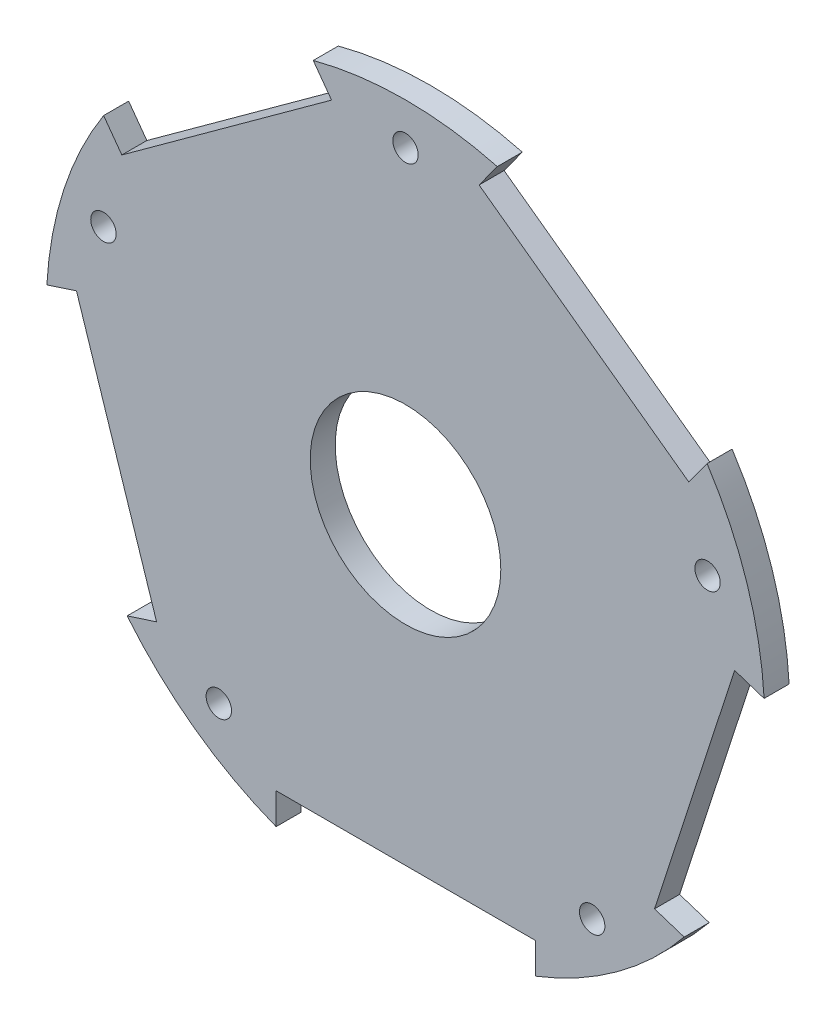
ISO-10303-21;
HEADER;
FILE_DESCRIPTION(('STEP AP214'),'2;1');
FILE_NAME('part.step','',(''),(''),'','','');
FILE_SCHEMA(('AUTOMOTIVE_DESIGN { 1 0 10303 214 1 1 1 1 }'));
ENDSEC;
DATA;
#1=APPLICATION_CONTEXT('core data for automotive mechanical design processes');
#2=APPLICATION_PROTOCOL_DEFINITION('international standard','automotive_design',2000,#1);
#3=PRODUCT_CONTEXT('',#1,'mechanical');
#4=PRODUCT('Part','Part','',(#3));
#5=PRODUCT_RELATED_PRODUCT_CATEGORY('part','',(#4));
#6=PRODUCT_DEFINITION_FORMATION('','',#4);
#7=PRODUCT_DEFINITION_CONTEXT('part definition',#1,'design');
#8=PRODUCT_DEFINITION('design','',#6,#7);
#9=PRODUCT_DEFINITION_SHAPE('','',#8);
#10=(LENGTH_UNIT() NAMED_UNIT(*) SI_UNIT(.MILLI.,.METRE.));
#11=(NAMED_UNIT(*) PLANE_ANGLE_UNIT() SI_UNIT($,.RADIAN.));
#12=(NAMED_UNIT(*) SI_UNIT($,.STERADIAN.) SOLID_ANGLE_UNIT());
#13=UNCERTAINTY_MEASURE_WITH_UNIT(LENGTH_MEASURE(1.E-05),#10,'distance_accuracy_value','');
#14=(GEOMETRIC_REPRESENTATION_CONTEXT(3) GLOBAL_UNCERTAINTY_ASSIGNED_CONTEXT((#13)) GLOBAL_UNIT_ASSIGNED_CONTEXT((#10,
#11,#12)) REPRESENTATION_CONTEXT('',''));
#15=CARTESIAN_POINT('',(0.,0.,0.));
#16=DIRECTION('',(0.,0.,1.));
#17=DIRECTION('',(1.,0.,0.));
#18=AXIS2_PLACEMENT_3D('',#15,#16,#17);
#19=CARTESIAN_POINT('',(124.233271228928,-185.773155673186,5.0038));
#20=DIRECTION('',(0.309016994374931,-0.951056516295159,0.));
#21=DIRECTION('',(0.951056516295159,0.309016994374931,0.));
#22=AXIS2_PLACEMENT_3D('',#19,#20,#21);
#23=PLANE('',#22);
#24=DIRECTION('',(-0.951056516295159,-0.309016994374931,0.));
#25=VECTOR('',#24,1.);
#26=CARTESIAN_POINT('',(124.233271228928,-185.773155673186,0.));
#27=LINE('',#26,#25);
#28=CARTESIAN_POINT('',(100.856418168785,-193.368755668369,0.));
#29=VERTEX_POINT('',#28);
#30=CARTESIAN_POINT('',(94.9700362155549,-195.281357104523,0.));
#31=VERTEX_POINT('',#30);
#32=EDGE_CURVE('E211',#29,#31,#27,.T.);
#33=ORIENTED_EDGE('',*,*,#32,.T.);
#34=DIRECTION('',(0.,0.,-1.));
#35=VECTOR('',#34,1.);
#36=CARTESIAN_POINT('',(94.9700362155549,-195.281357104523,5.0038));
#37=LINE('',#36,#35);
#38=CARTESIAN_POINT('',(94.9700362155549,-195.281357104523,5.0038));
#39=VERTEX_POINT('',#38);
#40=EDGE_CURVE('E11',#39,#31,#37,.T.);
#41=ORIENTED_EDGE('',*,*,#40,.F.);
#42=DIRECTION('',(-0.951056516295159,-0.309016994374931,0.));
#43=VECTOR('',#42,1.);
#44=CARTESIAN_POINT('',(124.233271228928,-185.773155673186,5.0038));
#45=LINE('',#44,#43);
#46=CARTESIAN_POINT('',(100.856418168785,-193.368755668369,5.0038));
#47=VERTEX_POINT('',#46);
#48=EDGE_CURVE('E320',#47,#39,#45,.T.);
#49=ORIENTED_EDGE('',*,*,#48,.F.);
#50=DIRECTION('',(0.,0.,-1.));
#51=VECTOR('',#50,1.);
#52=CARTESIAN_POINT('',(100.856418168785,-193.368755668369,5.0038));
#53=LINE('',#52,#51);
#54=EDGE_CURVE('E54',#47,#29,#53,.T.);
#55=ORIENTED_EDGE('',*,*,#54,.T.);
#56=EDGE_LOOP('',(#33,#41,#49,#55));
#57=FACE_BOUND('',#56,.T.);
#58=ADVANCED_FACE('F37',(#57),#23,.F.);
#59=CARTESIAN_POINT('',(150.608180965408,-149.916372010794,5.0038));
#60=DIRECTION('',(0.,0.,-1.));
#61=DIRECTION('',(-1.,0.,0.));
#62=AXIS2_PLACEMENT_3D('',#59,#60,#61);
#63=CYLINDRICAL_SURFACE('',#62,71.7884741707181);
#64=CARTESIAN_POINT('',(150.608180965408,-149.916372010794,0.));
#65=DIRECTION('',(0.,0.,1.));
#66=DIRECTION('',(1.,0.,0.));
#67=AXIS2_PLACEMENT_3D('',#64,#65,#66);
#68=CIRCLE('',#67,71.7884741707181);
#69=CARTESIAN_POINT('',(124.743713387235,-216.883635211984,0.));
#70=VERTEX_POINT('',#69);
#71=EDGE_CURVE('E214',#31,#70,#68,.T.);
#72=ORIENTED_EDGE('',*,*,#71,.T.);
#73=DIRECTION('',(0.,0.,-1.));
#74=VECTOR('',#73,1.);
#75=CARTESIAN_POINT('',(124.743713387235,-216.883635211984,5.0038));
#76=LINE('',#75,#74);
#77=CARTESIAN_POINT('',(124.743713387235,-216.883635211984,5.0038));
#78=VERTEX_POINT('',#77);
#79=EDGE_CURVE('E46',#78,#70,#76,.T.);
#80=ORIENTED_EDGE('',*,*,#79,.F.);
#81=CARTESIAN_POINT('',(150.608180965408,-149.916372010794,5.0038));
#82=DIRECTION('',(0.,0.,1.));
#83=DIRECTION('',(1.,0.,0.));
#84=AXIS2_PLACEMENT_3D('',#81,#82,#83);
#85=CIRCLE('',#84,71.7884741707181);
#86=EDGE_CURVE('E128',#39,#78,#85,.T.);
#87=ORIENTED_EDGE('',*,*,#86,.F.);
#88=ORIENTED_EDGE('',*,*,#40,.T.);
#89=EDGE_LOOP('',(#72,#80,#87,#88));
#90=FACE_BOUND('',#89,.T.);
#91=ADVANCED_FACE('F304',(#90),#63,.T.);
#92=CARTESIAN_POINT('',(124.743713387234,-300.002561728029,5.0038));
#93=DIRECTION('',(1.,0.,0.));
#94=DIRECTION('',(0.,1.,0.));
#95=AXIS2_PLACEMENT_3D('',#92,#93,#94);
#96=PLANE('',#95);
#97=DIRECTION('',(0.,-1.,0.));
#98=VECTOR('',#97,1.);
#99=CARTESIAN_POINT('',(124.743713387234,-300.002561728029,0.));
#100=LINE('',#99,#98);
#101=CARTESIAN_POINT('',(124.743713387235,-210.660635211985,0.));
#102=VERTEX_POINT('',#101);
#103=EDGE_CURVE('E217',#102,#70,#100,.T.);
#104=ORIENTED_EDGE('',*,*,#103,.F.);
#105=DIRECTION('',(0.,0.,-1.));
#106=VECTOR('',#105,1.);
#107=CARTESIAN_POINT('',(124.743713387235,-210.660635211985,5.0038));
#108=LINE('',#107,#106);
#109=CARTESIAN_POINT('',(124.743713387235,-210.660635211985,5.0038));
#110=VERTEX_POINT('',#109);
#111=EDGE_CURVE('E297',#110,#102,#108,.T.);
#112=ORIENTED_EDGE('',*,*,#111,.F.);
#113=DIRECTION('',(0.,-1.,0.));
#114=VECTOR('',#113,1.);
#115=CARTESIAN_POINT('',(124.743713387234,-300.002561728029,5.0038));
#116=LINE('',#115,#114);
#117=EDGE_CURVE('E303',#110,#78,#116,.T.);
#118=ORIENTED_EDGE('',*,*,#117,.T.);
#119=ORIENTED_EDGE('',*,*,#79,.T.);
#120=EDGE_LOOP('',(#104,#112,#118,#119));
#121=FACE_BOUND('',#120,.T.);
#122=ADVANCED_FACE('F301',(#121),#96,.T.);
#123=CARTESIAN_POINT('',(161.348655145131,-210.660635211985,5.0038));
#124=DIRECTION('',(0.,-1.,0.));
#125=DIRECTION('',(0.,0.,-1.));
#126=AXIS2_PLACEMENT_3D('',#123,#124,#125);
#127=PLANE('',#126);
#128=DIRECTION('',(-1.,0.,0.));
#129=VECTOR('',#128,1.);
#130=CARTESIAN_POINT('',(161.348655145131,-210.660635211985,0.));
#131=LINE('',#130,#129);
#132=CARTESIAN_POINT('',(176.559713387235,-210.660635211985,0.));
#133=VERTEX_POINT('',#132);
#134=EDGE_CURVE('E220',#133,#102,#131,.T.);
#135=ORIENTED_EDGE('',*,*,#134,.F.);
#136=DIRECTION('',(0.,0.,-1.));
#137=VECTOR('',#136,1.);
#138=CARTESIAN_POINT('',(176.559713387235,-210.660635211985,5.0038));
#139=LINE('',#138,#137);
#140=CARTESIAN_POINT('',(176.559713387235,-210.660635211985,5.0038));
#141=VERTEX_POINT('',#140);
#142=EDGE_CURVE('E295',#141,#133,#139,.T.);
#143=ORIENTED_EDGE('',*,*,#142,.F.);
#144=DIRECTION('',(-1.,0.,0.));
#145=VECTOR('',#144,1.);
#146=CARTESIAN_POINT('',(161.348655145131,-210.660635211985,5.0038));
#147=LINE('',#146,#145);
#148=EDGE_CURVE('E316',#141,#110,#147,.T.);
#149=ORIENTED_EDGE('',*,*,#148,.T.);
#150=ORIENTED_EDGE('',*,*,#111,.T.);
#151=EDGE_LOOP('',(#135,#143,#149,#150));
#152=FACE_BOUND('',#151,.T.);
#153=ADVANCED_FACE('F312',(#152),#127,.T.);
#154=CARTESIAN_POINT('',(176.559713387234,-300.00256172803,5.0038));
#155=DIRECTION('',(1.,0.,0.));
#156=DIRECTION('',(0.,1.,0.));
#157=AXIS2_PLACEMENT_3D('',#154,#155,#156);
#158=PLANE('',#157);
#159=DIRECTION('',(0.,-1.,0.));
#160=VECTOR('',#159,1.);
#161=CARTESIAN_POINT('',(176.559713387234,-300.00256172803,0.));
#162=LINE('',#161,#160);
#163=CARTESIAN_POINT('',(176.559713387235,-216.849943473244,0.));
#164=VERTEX_POINT('',#163);
#165=EDGE_CURVE('E223',#133,#164,#162,.T.);
#166=ORIENTED_EDGE('',*,*,#165,.T.);
#167=DIRECTION('',(0.,0.,-1.));
#168=VECTOR('',#167,1.);
#169=CARTESIAN_POINT('',(176.559713387235,-216.849943473244,5.0038));
#170=LINE('',#169,#168);
#171=CARTESIAN_POINT('',(176.559713387235,-216.849943473244,5.0038));
#172=VERTEX_POINT('',#171);
#173=EDGE_CURVE('E292',#172,#164,#170,.T.);
#174=ORIENTED_EDGE('',*,*,#173,.F.);
#175=DIRECTION('',(0.,-1.,0.));
#176=VECTOR('',#175,1.);
#177=CARTESIAN_POINT('',(176.559713387234,-300.00256172803,5.0038));
#178=LINE('',#177,#176);
#179=EDGE_CURVE('E318',#141,#172,#178,.T.);
#180=ORIENTED_EDGE('',*,*,#179,.F.);
#181=ORIENTED_EDGE('',*,*,#142,.T.);
#182=EDGE_LOOP('',(#166,#174,#180,#181));
#183=FACE_BOUND('',#182,.T.);
#184=ADVANCED_FACE('F383',(#183),#158,.F.);
#185=CARTESIAN_POINT('',(150.608180965408,-149.916372010794,5.0038));
#186=DIRECTION('',(0.,0.,-1.));
#187=DIRECTION('',(-1.,0.,0.));
#188=AXIS2_PLACEMENT_3D('',#185,#186,#187);
#189=CYLINDRICAL_SURFACE('',#188,71.7884741707186);
#190=CARTESIAN_POINT('',(150.608180965408,-149.916372010794,0.));
#191=DIRECTION('',(0.,0.,1.));
#192=DIRECTION('',(1.,0.,0.));
#193=AXIS2_PLACEMENT_3D('',#190,#191,#192);
#194=CIRCLE('',#193,71.7884741707186);
#195=CARTESIAN_POINT('',(206.305272979238,-195.208964837469,0.));
#196=VERTEX_POINT('',#195);
#197=EDGE_CURVE('E225',#164,#196,#194,.T.);
#198=ORIENTED_EDGE('',*,*,#197,.T.);
#199=DIRECTION('',(0.,0.,-1.));
#200=VECTOR('',#199,1.);
#201=CARTESIAN_POINT('',(206.305272979238,-195.208964837469,5.0038));
#202=LINE('',#201,#200);
#203=CARTESIAN_POINT('',(206.305272979238,-195.208964837469,5.0038));
#204=VERTEX_POINT('',#203);
#205=EDGE_CURVE('E290',#204,#196,#202,.T.);
#206=ORIENTED_EDGE('',*,*,#205,.F.);
#207=CARTESIAN_POINT('',(150.608180965408,-149.916372010794,5.0038));
#208=DIRECTION('',(0.,0.,1.));
#209=DIRECTION('',(1.,0.,0.));
#210=AXIS2_PLACEMENT_3D('',#207,#208,#209);
#211=CIRCLE('',#210,71.7884741707186);
#212=EDGE_CURVE('E325',#172,#204,#211,.T.);
#213=ORIENTED_EDGE('',*,*,#212,.F.);
#214=ORIENTED_EDGE('',*,*,#173,.T.);
#215=EDGE_LOOP('',(#198,#206,#213,#214));
#216=FACE_BOUND('',#215,.T.);
#217=ADVANCED_FACE('F386',(#216),#189,.T.);
#218=CARTESIAN_POINT('',(196.439695536956,-192.00344441176,5.0038));
#219=DIRECTION('',(0.309016994374956,0.951056516295151,0.));
#220=DIRECTION('',(-0.951056516295151,0.309016994374956,0.));
#221=AXIS2_PLACEMENT_3D('',#218,#219,#220);
#222=PLANE('',#221);
#223=DIRECTION('',(0.951056516295151,-0.309016994374956,0.));
#224=VECTOR('',#223,1.);
#225=CARTESIAN_POINT('',(196.439695536956,-192.00344441176,0.));
#226=LINE('',#225,#224);
#227=CARTESIAN_POINT('',(200.386848278333,-193.285952081473,0.));
#228=VERTEX_POINT('',#227);
#229=EDGE_CURVE('E228',#228,#196,#226,.T.);
#230=ORIENTED_EDGE('',*,*,#229,.F.);
#231=DIRECTION('',(0.,0.,-1.));
#232=VECTOR('',#231,1.);
#233=CARTESIAN_POINT('',(200.386848278333,-193.285952081473,5.0038));
#234=LINE('',#233,#232);
#235=CARTESIAN_POINT('',(200.386848278333,-193.285952081473,5.0038));
#236=VERTEX_POINT('',#235);
#237=EDGE_CURVE('E288',#236,#228,#234,.T.);
#238=ORIENTED_EDGE('',*,*,#237,.F.);
#239=DIRECTION('',(0.951056516295151,-0.309016994374956,0.));
#240=VECTOR('',#239,1.);
#241=CARTESIAN_POINT('',(196.439695536956,-192.00344441176,5.0038));
#242=LINE('',#241,#240);
#243=EDGE_CURVE('E327',#236,#204,#242,.T.);
#244=ORIENTED_EDGE('',*,*,#243,.T.);
#245=ORIENTED_EDGE('',*,*,#205,.T.);
#246=EDGE_LOOP('',(#230,#238,#244,#245));
#247=FACE_BOUND('',#246,.T.);
#248=ADVANCED_FACE('F390',(#247),#222,.T.);
#249=CARTESIAN_POINT('',(165.295807886508,-301.285069397743,5.0038));
#250=DIRECTION('',(0.95105651629515,-0.309016994374957,0.));
#251=DIRECTION('',(0.309016994374957,0.951056516295151,0.));
#252=AXIS2_PLACEMENT_3D('',#249,#250,#251);
#253=PLANE('',#252);
#254=DIRECTION('',(-0.309016994374957,-0.95105651629515,0.));
#255=VECTOR('',#254,1.);
#256=CARTESIAN_POINT('',(165.295807886508,-301.285069397743,0.));
#257=LINE('',#256,#255);
#258=CARTESIAN_POINT('',(216.398872858866,-144.006007633124,0.));
#259=VERTEX_POINT('',#258);
#260=EDGE_CURVE('E231',#259,#228,#257,.T.);
#261=ORIENTED_EDGE('',*,*,#260,.F.);
#262=DIRECTION('',(0.,0.,-1.));
#263=VECTOR('',#262,1.);
#264=CARTESIAN_POINT('',(216.398872858866,-144.006007633124,5.0038));
#265=LINE('',#264,#263);
#266=CARTESIAN_POINT('',(216.398872858866,-144.006007633124,5.0038));
#267=VERTEX_POINT('',#266);
#268=EDGE_CURVE('E286',#267,#259,#265,.T.);
#269=ORIENTED_EDGE('',*,*,#268,.F.);
#270=DIRECTION('',(-0.309016994374957,-0.95105651629515,0.));
#271=VECTOR('',#270,1.);
#272=CARTESIAN_POINT('',(165.295807886508,-301.285069397743,5.0038));
#273=LINE('',#272,#271);
#274=EDGE_CURVE('E330',#267,#236,#273,.T.);
#275=ORIENTED_EDGE('',*,*,#274,.T.);
#276=ORIENTED_EDGE('',*,*,#237,.T.);
#277=EDGE_LOOP('',(#261,#269,#275,#276));
#278=FACE_BOUND('',#277,.T.);
#279=ADVANCED_FACE('F394',(#278),#253,.T.);
#280=CARTESIAN_POINT('',(212.451720117488,-142.72349996341,5.0038));
#281=DIRECTION('',(0.309016994374954,0.951056516295151,0.));
#282=DIRECTION('',(-0.951056516295151,0.309016994374954,0.));
#283=AXIS2_PLACEMENT_3D('',#280,#281,#282);
#284=PLANE('',#283);
#285=DIRECTION('',(0.951056516295151,-0.309016994374954,0.));
#286=VECTOR('',#285,1.);
#287=CARTESIAN_POINT('',(212.451720117488,-142.72349996341,0.));
#288=LINE('',#287,#286);
#289=CARTESIAN_POINT('',(222.285254812095,-145.918609069278,0.));
#290=VERTEX_POINT('',#289);
#291=EDGE_CURVE('E234',#259,#290,#288,.T.);
#292=ORIENTED_EDGE('',*,*,#291,.T.);
#293=DIRECTION('',(0.,0.,-1.));
#294=VECTOR('',#293,1.);
#295=CARTESIAN_POINT('',(222.285254812095,-145.918609069278,5.0038));
#296=LINE('',#295,#294);
#297=CARTESIAN_POINT('',(222.285254812095,-145.918609069278,5.0038));
#298=VERTEX_POINT('',#297);
#299=EDGE_CURVE('E283',#298,#290,#296,.T.);
#300=ORIENTED_EDGE('',*,*,#299,.F.);
#301=DIRECTION('',(0.951056516295151,-0.309016994374954,0.));
#302=VECTOR('',#301,1.);
#303=CARTESIAN_POINT('',(212.451720117488,-142.72349996341,5.0038));
#304=LINE('',#303,#302);
#305=EDGE_CURVE('E333',#267,#298,#304,.T.);
#306=ORIENTED_EDGE('',*,*,#305,.F.);
#307=ORIENTED_EDGE('',*,*,#268,.T.);
#308=EDGE_LOOP('',(#292,#300,#306,#307));
#309=FACE_BOUND('',#308,.T.);
#310=ADVANCED_FACE('F398',(#309),#284,.F.);
#311=CARTESIAN_POINT('',(150.608180965408,-149.916372010794,5.0038));
#312=DIRECTION('',(0.,0.,-1.));
#313=DIRECTION('',(-1.,0.,0.));
#314=AXIS2_PLACEMENT_3D('',#311,#312,#313);
#315=CYLINDRICAL_SURFACE('',#314,71.788474170719);
#316=CARTESIAN_POINT('',(150.608180965408,-149.916372010794,0.));
#317=DIRECTION('',(0.,0.,1.));
#318=DIRECTION('',(1.,0.,0.));
#319=AXIS2_PLACEMENT_3D('',#316,#317,#318);
#320=CIRCLE('',#319,71.788474170719);
#321=CARTESIAN_POINT('',(210.895344482659,-110.941470615098,0.));
#322=VERTEX_POINT('',#321);
#323=EDGE_CURVE('E236',#290,#322,#320,.T.);
#324=ORIENTED_EDGE('',*,*,#323,.T.);
#325=DIRECTION('',(0.,0.,-1.));
#326=VECTOR('',#325,1.);
#327=CARTESIAN_POINT('',(210.895344482659,-110.941470615098,5.0038));
#328=LINE('',#327,#326);
#329=CARTESIAN_POINT('',(210.895344482659,-110.941470615098,5.0038));
#330=VERTEX_POINT('',#329);
#331=EDGE_CURVE('E281',#330,#322,#328,.T.);
#332=ORIENTED_EDGE('',*,*,#331,.F.);
#333=CARTESIAN_POINT('',(150.608180965408,-149.916372010794,5.0038));
#334=DIRECTION('',(0.,0.,1.));
#335=DIRECTION('',(1.,0.,0.));
#336=AXIS2_PLACEMENT_3D('',#333,#334,#335);
#337=CIRCLE('',#336,71.788474170719);
#338=EDGE_CURVE('E335',#298,#330,#337,.T.);
#339=ORIENTED_EDGE('',*,*,#338,.F.);
#340=ORIENTED_EDGE('',*,*,#299,.T.);
#341=EDGE_LOOP('',(#324,#332,#339,#340));
#342=FACE_BOUND('',#341,.T.);
#343=ADVANCED_FACE('F402',(#342),#315,.T.);
#344=CARTESIAN_POINT('',(103.873492983637,-258.2444121137,5.0038));
#345=DIRECTION('',(-0.809016994374942,0.587785252292481,0.));
#346=DIRECTION('',(-0.587785252292481,-0.809016994374942,0.));
#347=AXIS2_PLACEMENT_3D('',#344,#345,#346);
#348=PLANE('',#347);
#349=DIRECTION('',(0.587785252292481,0.809016994374942,0.));
#350=VECTOR('',#349,1.);
#351=CARTESIAN_POINT('',(103.873492983637,-258.2444121137,0.));
#352=LINE('',#351,#350);
#353=CARTESIAN_POINT('',(207.237556857643,-115.975983371093,0.));
#354=VERTEX_POINT('',#353);
#355=EDGE_CURVE('E239',#354,#322,#352,.T.);
#356=ORIENTED_EDGE('',*,*,#355,.F.);
#357=DIRECTION('',(0.,0.,-1.));
#358=VECTOR('',#357,1.);
#359=CARTESIAN_POINT('',(207.237556857643,-115.975983371093,5.0038));
#360=LINE('',#359,#358);
#361=CARTESIAN_POINT('',(207.237556857643,-115.975983371093,5.0038));
#362=VERTEX_POINT('',#361);
#363=EDGE_CURVE('E279',#362,#354,#360,.T.);
#364=ORIENTED_EDGE('',*,*,#363,.F.);
#365=DIRECTION('',(0.587785252292481,0.809016994374942,0.));
#366=VECTOR('',#365,1.);
#367=CARTESIAN_POINT('',(103.873492983637,-258.2444121137,5.0038));
#368=LINE('',#367,#366);
#369=EDGE_CURVE('E337',#362,#330,#368,.T.);
#370=ORIENTED_EDGE('',*,*,#369,.T.);
#371=ORIENTED_EDGE('',*,*,#331,.T.);
#372=EDGE_LOOP('',(#356,#364,#370,#371));
#373=FACE_BOUND('',#372,.T.);
#374=ADVANCED_FACE('F406',(#373),#348,.T.);
#375=CARTESIAN_POINT('',(264.712719019136,-157.734132985423,5.0038));
#376=DIRECTION('',(0.587785252292479,0.809016994374943,0.));
#377=DIRECTION('',(-0.809016994374943,0.587785252292479,0.));
#378=AXIS2_PLACEMENT_3D('',#375,#376,#377);
#379=PLANE('',#378);
#380=DIRECTION('',(0.809016994374943,-0.587785252292479,0.));
#381=VECTOR('',#380,1.);
#382=CARTESIAN_POINT('',(264.712719019136,-157.734132985423,0.));
#383=LINE('',#382,#381);
#384=CARTESIAN_POINT('',(165.317532277111,-85.5193027383062,0.));
#385=VERTEX_POINT('',#384);
#386=EDGE_CURVE('E242',#385,#354,#383,.T.);
#387=ORIENTED_EDGE('',*,*,#386,.F.);
#388=DIRECTION('',(0.,0.,-1.));
#389=VECTOR('',#388,1.);
#390=CARTESIAN_POINT('',(165.317532277111,-85.5193027383062,5.0038));
#391=LINE('',#390,#389);
#392=CARTESIAN_POINT('',(165.317532277111,-85.5193027383062,5.0038));
#393=VERTEX_POINT('',#392);
#394=EDGE_CURVE('E277',#393,#385,#391,.T.);
#395=ORIENTED_EDGE('',*,*,#394,.F.);
#396=DIRECTION('',(0.809016994374943,-0.587785252292479,0.));
#397=VECTOR('',#396,1.);
#398=CARTESIAN_POINT('',(264.712719019136,-157.734132985423,5.0038));
#399=LINE('',#398,#397);
#400=EDGE_CURVE('E340',#393,#362,#399,.T.);
#401=ORIENTED_EDGE('',*,*,#400,.T.);
#402=ORIENTED_EDGE('',*,*,#363,.T.);
#403=EDGE_LOOP('',(#387,#395,#401,#402));
#404=FACE_BOUND('',#403,.T.);
#405=ADVANCED_FACE('F410',(#404),#379,.T.);
#406=CARTESIAN_POINT('',(61.953468403106,-227.787731480914,5.0038));
#407=DIRECTION('',(-0.809016994374946,0.587785252292475,0.));
#408=DIRECTION('',(-0.587785252292475,-0.809016994374946,0.));
#409=AXIS2_PLACEMENT_3D('',#406,#407,#408);
#410=PLANE('',#409);
#411=DIRECTION('',(0.587785252292475,0.809016994374946,0.));
#412=VECTOR('',#411,1.);
#413=CARTESIAN_POINT('',(61.953468403106,-227.787731480914,0.));
#414=LINE('',#413,#412);
#415=CARTESIAN_POINT('',(168.955516394971,-80.5120471715232,0.));
#416=VERTEX_POINT('',#415);
#417=EDGE_CURVE('E245',#385,#416,#414,.T.);
#418=ORIENTED_EDGE('',*,*,#417,.T.);
#419=DIRECTION('',(0.,0.,-1.));
#420=VECTOR('',#419,1.);
#421=CARTESIAN_POINT('',(168.955516394971,-80.5120471715232,5.0038));
#422=LINE('',#421,#420);
#423=CARTESIAN_POINT('',(168.955516394971,-80.5120471715232,5.0038));
#424=VERTEX_POINT('',#423);
#425=EDGE_CURVE('E274',#424,#416,#422,.T.);
#426=ORIENTED_EDGE('',*,*,#425,.F.);
#427=DIRECTION('',(0.587785252292475,0.809016994374946,0.));
#428=VECTOR('',#427,1.);
#429=CARTESIAN_POINT('',(61.953468403106,-227.787731480914,5.0038));
#430=LINE('',#429,#428);
#431=EDGE_CURVE('E343',#393,#424,#430,.T.);
#432=ORIENTED_EDGE('',*,*,#431,.F.);
#433=ORIENTED_EDGE('',*,*,#394,.T.);
#434=EDGE_LOOP('',(#418,#426,#432,#433));
#435=FACE_BOUND('',#434,.T.);
#436=ADVANCED_FACE('F414',(#435),#410,.F.);
#437=CARTESIAN_POINT('',(150.608180965408,-149.916372010794,5.0038));
#438=DIRECTION('',(0.,0.,-1.));
#439=DIRECTION('',(-1.,0.,0.));
#440=AXIS2_PLACEMENT_3D('',#437,#438,#439);
#441=CYLINDRICAL_SURFACE('',#440,71.7884741707187);
#442=CARTESIAN_POINT('',(150.608180965408,-149.916372010794,0.));
#443=DIRECTION('',(0.,0.,1.));
#444=DIRECTION('',(1.,0.,0.));
#445=AXIS2_PLACEMENT_3D('',#442,#443,#444);
#446=CIRCLE('',#445,71.7884741707187);
#447=CARTESIAN_POINT('',(132.170605090563,-80.5359654134034,0.));
#448=VERTEX_POINT('',#447);
#449=EDGE_CURVE('E247',#416,#448,#446,.T.);
#450=ORIENTED_EDGE('',*,*,#449,.T.);
#451=DIRECTION('',(0.,0.,-1.));
#452=VECTOR('',#451,1.);
#453=CARTESIAN_POINT('',(132.170605090563,-80.5359654134034,5.0038));
#454=LINE('',#453,#452);
#455=CARTESIAN_POINT('',(132.170605090563,-80.5359654134034,5.0038));
#456=VERTEX_POINT('',#455);
#457=EDGE_CURVE('E272',#456,#448,#454,.T.);
#458=ORIENTED_EDGE('',*,*,#457,.F.);
#459=CARTESIAN_POINT('',(150.608180965408,-149.916372010794,5.0038));
#460=DIRECTION('',(0.,0.,1.));
#461=DIRECTION('',(1.,0.,0.));
#462=AXIS2_PLACEMENT_3D('',#459,#460,#461);
#463=CIRCLE('',#462,71.7884741707187);
#464=EDGE_CURVE('E345',#424,#456,#463,.T.);
#465=ORIENTED_EDGE('',*,*,#464,.F.);
#466=ORIENTED_EDGE('',*,*,#425,.T.);
#467=EDGE_LOOP('',(#450,#458,#465,#466));
#468=FACE_BOUND('',#467,.T.);
#469=ADVANCED_FACE('F418',(#468),#441,.T.);
#470=CARTESIAN_POINT('',(246.613941720126,-238.053704868732,5.0038));
#471=DIRECTION('',(-0.809016994374952,-0.587785252292467,0.));
#472=DIRECTION('',(0.587785252292467,-0.809016994374952,0.));
#473=AXIS2_PLACEMENT_3D('',#470,#471,#472);
#474=PLANE('',#473);
#475=DIRECTION('',(-0.587785252292467,0.809016994374952,0.));
#476=VECTOR('',#475,1.);
#477=CARTESIAN_POINT('',(246.613941720126,-238.053704868732,0.));
#478=LINE('',#477,#476);
#479=CARTESIAN_POINT('',(135.828392715579,-85.5704781693988,0.));
#480=VERTEX_POINT('',#479);
#481=EDGE_CURVE('E250',#480,#448,#478,.T.);
#482=ORIENTED_EDGE('',*,*,#481,.F.);
#483=DIRECTION('',(0.,0.,-1.));
#484=VECTOR('',#483,1.);
#485=CARTESIAN_POINT('',(135.828392715579,-85.5704781693988,5.0038));
#486=LINE('',#485,#484);
#487=CARTESIAN_POINT('',(135.828392715579,-85.5704781693988,5.0038));
#488=VERTEX_POINT('',#487);
#489=EDGE_CURVE('E270',#488,#480,#486,.T.);
#490=ORIENTED_EDGE('',*,*,#489,.F.);
#491=DIRECTION('',(-0.587785252292467,0.809016994374952,0.));
#492=VECTOR('',#491,1.);
#493=CARTESIAN_POINT('',(246.613941720126,-238.053704868732,5.0038));
#494=LINE('',#493,#492);
#495=EDGE_CURVE('E347',#488,#456,#494,.T.);
#496=ORIENTED_EDGE('',*,*,#495,.T.);
#497=ORIENTED_EDGE('',*,*,#457,.T.);
#498=EDGE_LOOP('',(#482,#490,#496,#497));
#499=FACE_BOUND('',#498,.T.);
#500=ADVANCED_FACE('F360',(#499),#474,.T.);
#501=CARTESIAN_POINT('',(50.5631061405838,-147.519335028697,5.0038));
#502=DIRECTION('',(-0.587785252292469,0.80901699437495,0.));
#503=DIRECTION('',(-0.80901699437495,-0.587785252292469,0.));
#504=AXIS2_PLACEMENT_3D('',#501,#502,#503);
#505=PLANE('',#504);
#506=DIRECTION('',(0.80901699437495,0.587785252292469,0.));
#507=VECTOR('',#506,1.);
#508=CARTESIAN_POINT('',(50.5631061405838,-147.519335028697,0.));
#509=LINE('',#508,#507);
#510=CARTESIAN_POINT('',(93.9083681350467,-116.027158802185,0.));
#511=VERTEX_POINT('',#510);
#512=EDGE_CURVE('E253',#511,#480,#509,.T.);
#513=ORIENTED_EDGE('',*,*,#512,.F.);
#514=DIRECTION('',(0.,0.,-1.));
#515=VECTOR('',#514,1.);
#516=CARTESIAN_POINT('',(93.9083681350467,-116.027158802185,5.0038));
#517=LINE('',#516,#515);
#518=CARTESIAN_POINT('',(93.9083681350467,-116.027158802185,5.0038));
#519=VERTEX_POINT('',#518);
#520=EDGE_CURVE('E268',#519,#511,#517,.T.);
#521=ORIENTED_EDGE('',*,*,#520,.F.);
#522=DIRECTION('',(0.80901699437495,0.587785252292469,0.));
#523=VECTOR('',#522,1.);
#524=CARTESIAN_POINT('',(50.5631061405838,-147.519335028697,5.0038));
#525=LINE('',#524,#523);
#526=EDGE_CURVE('E350',#519,#488,#525,.T.);
#527=ORIENTED_EDGE('',*,*,#526,.T.);
#528=ORIENTED_EDGE('',*,*,#489,.T.);
#529=EDGE_LOOP('',(#513,#521,#527,#528));
#530=FACE_BOUND('',#529,.T.);
#531=ADVANCED_FACE('F354',(#530),#505,.T.);
#532=CARTESIAN_POINT('',(204.693917139594,-268.510385501518,5.0038));
#533=DIRECTION('',(-0.809016994374949,-0.587785252292471,0.));
#534=DIRECTION('',(0.587785252292471,-0.809016994374949,0.));
#535=AXIS2_PLACEMENT_3D('',#532,#533,#534);
#536=PLANE('',#535);
#537=DIRECTION('',(-0.587785252292471,0.809016994374949,0.));
#538=VECTOR('',#537,1.);
#539=CARTESIAN_POINT('',(204.693917139594,-268.510385501518,0.));
#540=LINE('',#539,#538);
#541=CARTESIAN_POINT('',(90.2703840171868,-111.019903235402,0.));
#542=VERTEX_POINT('',#541);
#543=EDGE_CURVE('E256',#511,#542,#540,.T.);
#544=ORIENTED_EDGE('',*,*,#543,.T.);
#545=DIRECTION('',(0.,0.,-1.));
#546=VECTOR('',#545,1.);
#547=CARTESIAN_POINT('',(90.2703840171868,-111.019903235402,5.0038));
#548=LINE('',#547,#546);
#549=CARTESIAN_POINT('',(90.2703840171868,-111.019903235402,5.0038));
#550=VERTEX_POINT('',#549);
#551=EDGE_CURVE('E200',#550,#542,#548,.T.);
#552=ORIENTED_EDGE('',*,*,#551,.F.);
#553=DIRECTION('',(-0.587785252292471,0.809016994374949,0.));
#554=VECTOR('',#553,1.);
#555=CARTESIAN_POINT('',(204.693917139594,-268.510385501518,5.0038));
#556=LINE('',#555,#554);
#557=EDGE_CURVE('E188',#519,#550,#556,.T.);
#558=ORIENTED_EDGE('',*,*,#557,.F.);
#559=ORIENTED_EDGE('',*,*,#520,.T.);
#560=EDGE_LOOP('',(#544,#552,#558,#559));
#561=FACE_BOUND('',#560,.T.);
#562=ADVANCED_FACE('F364',(#561),#536,.F.);
#563=CARTESIAN_POINT('',(150.608180965408,-149.916372010794,5.0038));
#564=DIRECTION('',(0.,0.,-1.));
#565=DIRECTION('',(-1.,0.,0.));
#566=AXIS2_PLACEMENT_3D('',#563,#564,#565);
#567=CYLINDRICAL_SURFACE('',#566,71.7884741707182);
#568=CARTESIAN_POINT('',(150.608180965408,-149.916372010794,0.));
#569=DIRECTION('',(0.,0.,1.));
#570=DIRECTION('',(1.,0.,0.));
#571=AXIS2_PLACEMENT_3D('',#568,#569,#570);
#572=CIRCLE('',#571,71.7884741707182);
#573=CARTESIAN_POINT('',(78.9259688873487,-146.011823976014,0.));
#574=VERTEX_POINT('',#573);
#575=EDGE_CURVE('E197',#542,#574,#572,.T.);
#576=ORIENTED_EDGE('',*,*,#575,.T.);
#577=DIRECTION('',(0.,0.,-1.));
#578=VECTOR('',#577,1.);
#579=CARTESIAN_POINT('',(78.9259688873487,-146.011823976014,5.0038));
#580=LINE('',#579,#578);
#581=CARTESIAN_POINT('',(78.9259688873487,-146.011823976014,5.0038));
#582=VERTEX_POINT('',#581);
#583=EDGE_CURVE('E194',#582,#574,#580,.T.);
#584=ORIENTED_EDGE('',*,*,#583,.F.);
#585=CARTESIAN_POINT('',(150.608180965408,-149.916372010794,5.0038));
#586=DIRECTION('',(0.,0.,1.));
#587=DIRECTION('',(1.,0.,0.));
#588=AXIS2_PLACEMENT_3D('',#585,#586,#587);
#589=CIRCLE('',#588,71.7884741707182);
#590=EDGE_CURVE('E180',#550,#582,#589,.T.);
#591=ORIENTED_EDGE('',*,*,#590,.F.);
#592=ORIENTED_EDGE('',*,*,#551,.T.);
#593=EDGE_LOOP('',(#576,#584,#591,#592));
#594=FACE_BOUND('',#593,.T.);
#595=ADVANCED_FACE('F195',(#594),#567,.T.);
#596=CARTESIAN_POINT('',(108.221246648397,-136.493211224836,5.0038));
#597=DIRECTION('',(0.309016994374928,-0.95105651629516,0.));
#598=DIRECTION('',(0.95105651629516,0.309016994374928,0.));
#599=AXIS2_PLACEMENT_3D('',#596,#597,#598);
#600=PLANE('',#599);
#601=DIRECTION('',(-0.95105651629516,-0.309016994374928,0.));
#602=VECTOR('',#601,1.);
#603=CARTESIAN_POINT('',(108.221246648397,-136.493211224836,0.));
#604=LINE('',#603,#602);
#605=CARTESIAN_POINT('',(84.8443935882536,-144.088811220019,0.));
#606=VERTEX_POINT('',#605);
#607=EDGE_CURVE('E259',#606,#574,#604,.T.);
#608=ORIENTED_EDGE('',*,*,#607,.F.);
#609=DIRECTION('',(0.,0.,-1.));
#610=VECTOR('',#609,1.);
#611=CARTESIAN_POINT('',(84.8443935882536,-144.088811220019,5.0038));
#612=LINE('',#611,#610);
#613=CARTESIAN_POINT('',(84.8443935882536,-144.088811220019,5.0038));
#614=VERTEX_POINT('',#613);
#615=EDGE_CURVE('E116',#614,#606,#612,.T.);
#616=ORIENTED_EDGE('',*,*,#615,.F.);
#617=DIRECTION('',(-0.95105651629516,-0.309016994374928,0.));
#618=VECTOR('',#617,1.);
#619=CARTESIAN_POINT('',(108.221246648397,-136.493211224836,5.0038));
#620=LINE('',#619,#618);
#621=EDGE_CURVE('E185',#614,#582,#620,.T.);
#622=ORIENTED_EDGE('',*,*,#621,.T.);
#623=ORIENTED_EDGE('',*,*,#583,.T.);
#624=EDGE_LOOP('',(#608,#616,#622,#623));
#625=FACE_BOUND('',#624,.T.);
#626=ADVANCED_FACE('F202',(#625),#600,.T.);
#627=CARTESIAN_POINT('',(150.608180965408,-149.916372010794,5.0038));
#628=DIRECTION('',(0.,0.,-1.));
#629=DIRECTION('',(-1.,0.,0.));
#630=AXIS2_PLACEMENT_3D('',#627,#628,#629);
#631=CYLINDRICAL_SURFACE('',#630,19.05);
#632=CARTESIAN_POINT('',(150.608180965408,-149.916372010794,5.0038));
#633=DIRECTION('',(0.,0.,1.));
#634=DIRECTION('',(1.,0.,0.));
#635=AXIS2_PLACEMENT_3D('',#632,#633,#634);
#636=CIRCLE('',#635,19.05);
#637=CARTESIAN_POINT('',(169.658180965408,-149.916372010794,5.0038));
#638=VERTEX_POINT('',#637);
#639=EDGE_CURVE('E264',#638,#638,#636,.T.);
#640=ORIENTED_EDGE('',*,*,#639,.T.);
#641=EDGE_LOOP('',(#640));
#642=FACE_BOUND('',#641,.T.);
#643=CARTESIAN_POINT('',(150.608180965408,-149.916372010794,0.));
#644=DIRECTION('',(0.,0.,1.));
#645=DIRECTION('',(1.,0.,0.));
#646=AXIS2_PLACEMENT_3D('',#643,#644,#645);
#647=CIRCLE('',#646,19.05);
#648=CARTESIAN_POINT('',(169.658180965408,-149.916372010794,0.));
#649=VERTEX_POINT('',#648);
#650=EDGE_CURVE('E208',#649,#649,#647,.T.);
#651=ORIENTED_EDGE('',*,*,#650,.F.);
#652=EDGE_LOOP('',(#651));
#653=FACE_BOUND('',#652,.T.);
#654=ADVANCED_FACE('F39',(#642,#653),#631,.F.);
#655=CARTESIAN_POINT('',(137.971802084988,-307.598161723212,5.0038));
#656=DIRECTION('',(-0.951056516295159,-0.309016994374932,0.));
#657=DIRECTION('',(0.309016994374932,-0.951056516295159,0.));
#658=AXIS2_PLACEMENT_3D('',#655,#656,#657);
#659=PLANE('',#658);
#660=DIRECTION('',(-0.309016994374932,0.951056516295159,0.));
#661=VECTOR('',#660,1.);
#662=CARTESIAN_POINT('',(137.971802084988,-307.598161723212,0.));
#663=LINE('',#662,#661);
#664=EDGE_CURVE('E261',#29,#606,#663,.T.);
#665=ORIENTED_EDGE('',*,*,#664,.F.);
#666=ORIENTED_EDGE('',*,*,#54,.F.);
#667=DIRECTION('',(-0.309016994374932,0.951056516295159,0.));
#668=VECTOR('',#667,1.);
#669=CARTESIAN_POINT('',(137.971802084988,-307.598161723212,5.0038));
#670=LINE('',#669,#668);
#671=EDGE_CURVE('E203',#47,#614,#670,.T.);
#672=ORIENTED_EDGE('',*,*,#671,.T.);
#673=ORIENTED_EDGE('',*,*,#615,.T.);
#674=EDGE_LOOP('',(#665,#666,#672,#673));
#675=FACE_BOUND('',#674,.T.);
#676=ADVANCED_FACE('F459',(#675),#659,.T.);
#677=CARTESIAN_POINT('',(161.348655145131,-300.00256172803,5.0038));
#678=DIRECTION('',(0.,0.,1.));
#679=DIRECTION('',(1.,0.,0.));
#680=AXIS2_PLACEMENT_3D('',#677,#678,#679);
#681=PLANE('',#680);
#682=CARTESIAN_POINT('',(90.2343928355552,-130.299513616489,5.0038));
#683=DIRECTION('',(0.,0.,1.));
#684=DIRECTION('',(1.,0.,0.));
#685=AXIS2_PLACEMENT_3D('',#682,#683,#684);
#686=CIRCLE('',#685,2.53999999999998);
#687=CARTESIAN_POINT('',(92.7743928355552,-130.299513616489,5.0038));
#688=VERTEX_POINT('',#687);
#689=EDGE_CURVE('E542',#688,#688,#686,.T.);
#690=ORIENTED_EDGE('',*,*,#689,.F.);
#691=EDGE_LOOP('',(#690));
#692=FACE_BOUND('',#691,.T.);
#693=CARTESIAN_POINT('',(113.294913413348,-201.273314005027,5.0038));
#694=DIRECTION('',(0.,0.,1.));
#695=DIRECTION('',(1.,0.,0.));
#696=AXIS2_PLACEMENT_3D('',#693,#694,#695);
#697=CIRCLE('',#696,2.53999999999998);
#698=CARTESIAN_POINT('',(115.834913413348,-201.273314005027,5.0038));
#699=VERTEX_POINT('',#698);
#700=EDGE_CURVE('E552',#699,#699,#697,.T.);
#701=ORIENTED_EDGE('',*,*,#700,.F.);
#702=EDGE_LOOP('',(#701));
#703=FACE_BOUND('',#702,.T.);
#704=CARTESIAN_POINT('',(187.921101516769,-201.273566115792,5.0038));
#705=DIRECTION('',(0.,0.,1.));
#706=DIRECTION('',(1.,0.,0.));
#707=AXIS2_PLACEMENT_3D('',#704,#705,#706);
#708=CIRCLE('',#707,2.53999999999998);
#709=CARTESIAN_POINT('',(190.461101516769,-201.273566115792,5.0038));
#710=VERTEX_POINT('',#709);
#711=EDGE_CURVE('E558',#710,#710,#708,.T.);
#712=ORIENTED_EDGE('',*,*,#711,.F.);
#713=EDGE_LOOP('',(#712));
#714=FACE_BOUND('',#713,.T.);
#715=CARTESIAN_POINT('',(210.982101637734,-130.299921540276,5.0038));
#716=DIRECTION('',(0.,0.,1.));
#717=DIRECTION('',(1.,0.,0.));
#718=AXIS2_PLACEMENT_3D('',#715,#716,#717);
#719=CIRCLE('',#718,2.53999999999998);
#720=CARTESIAN_POINT('',(213.522101637734,-130.299921540276,5.0038));
#721=VERTEX_POINT('',#720);
#722=EDGE_CURVE('E564',#721,#721,#719,.T.);
#723=ORIENTED_EDGE('',*,*,#722,.F.);
#724=EDGE_LOOP('',(#723));
#725=FACE_BOUND('',#724,.T.);
#726=CARTESIAN_POINT('',(150.608395423634,-86.4355447763873,5.0038));
#727=DIRECTION('',(0.,0.,1.));
#728=DIRECTION('',(1.,0.,0.));
#729=AXIS2_PLACEMENT_3D('',#726,#727,#728);
#730=CIRCLE('',#729,2.53999999999998);
#731=CARTESIAN_POINT('',(153.148395423634,-86.4355447763873,5.0038));
#732=VERTEX_POINT('',#731);
#733=EDGE_CURVE('E212',#732,#732,#730,.T.);
#734=ORIENTED_EDGE('',*,*,#733,.F.);
#735=EDGE_LOOP('',(#734));
#736=FACE_BOUND('',#735,.T.);
#737=ORIENTED_EDGE('',*,*,#639,.F.);
#738=EDGE_LOOP('',(#737));
#739=FACE_BOUND('',#738,.T.);
#740=ORIENTED_EDGE('',*,*,#48,.T.);
#741=ORIENTED_EDGE('',*,*,#86,.T.);
#742=ORIENTED_EDGE('',*,*,#117,.F.);
#743=ORIENTED_EDGE('',*,*,#148,.F.);
#744=ORIENTED_EDGE('',*,*,#179,.T.);
#745=ORIENTED_EDGE('',*,*,#212,.T.);
#746=ORIENTED_EDGE('',*,*,#243,.F.);
#747=ORIENTED_EDGE('',*,*,#274,.F.);
#748=ORIENTED_EDGE('',*,*,#305,.T.);
#749=ORIENTED_EDGE('',*,*,#338,.T.);
#750=ORIENTED_EDGE('',*,*,#369,.F.);
#751=ORIENTED_EDGE('',*,*,#400,.F.);
#752=ORIENTED_EDGE('',*,*,#431,.T.);
#753=ORIENTED_EDGE('',*,*,#464,.T.);
#754=ORIENTED_EDGE('',*,*,#495,.F.);
#755=ORIENTED_EDGE('',*,*,#526,.F.);
#756=ORIENTED_EDGE('',*,*,#557,.T.);
#757=ORIENTED_EDGE('',*,*,#590,.T.);
#758=ORIENTED_EDGE('',*,*,#621,.F.);
#759=ORIENTED_EDGE('',*,*,#671,.F.);
#760=EDGE_LOOP('',(#740,#741,#742,#743,#744,#745,#746,#747,#748,#749,#750,#751,#752,#753,#754,
#755,#756,#757,#758,#759));
#761=FACE_BOUND('',#760,.T.);
#762=ADVANCED_FACE('F182',(#692,#703,#714,#725,#736,#739,#761),#681,.T.);
#763=CARTESIAN_POINT('',(161.348655145131,-300.00256172803,0.));
#764=DIRECTION('',(0.,0.,1.));
#765=DIRECTION('',(1.,0.,0.));
#766=AXIS2_PLACEMENT_3D('',#763,#764,#765);
#767=PLANE('',#766);
#768=CARTESIAN_POINT('',(90.2343928355552,-130.299513616489,0.));
#769=DIRECTION('',(0.,0.,-1.));
#770=DIRECTION('',(-0.309016994374958,-0.95105651629515,0.));
#771=AXIS2_PLACEMENT_3D('',#768,#769,#770);
#772=CIRCLE('',#771,2.53999999999998);
#773=CARTESIAN_POINT('',(89.4494896698428,-132.715197167878,0.));
#774=VERTEX_POINT('',#773);
#775=EDGE_CURVE('E545',#774,#774,#772,.T.);
#776=ORIENTED_EDGE('',*,*,#775,.F.);
#777=EDGE_LOOP('',(#776));
#778=FACE_BOUND('',#777,.T.);
#779=CARTESIAN_POINT('',(113.294913413348,-201.273314005027,0.));
#780=DIRECTION('',(0.,0.,-1.));
#781=DIRECTION('',(0.809016994374942,-0.58778525229248,0.));
#782=AXIS2_PLACEMENT_3D('',#779,#780,#781);
#783=CIRCLE('',#782,2.53999999999998);
#784=CARTESIAN_POINT('',(115.34981657906,-202.76628854585,0.));
#785=VERTEX_POINT('',#784);
#786=EDGE_CURVE('E547',#785,#785,#783,.T.);
#787=ORIENTED_EDGE('',*,*,#786,.F.);
#788=EDGE_LOOP('',(#787));
#789=FACE_BOUND('',#788,.T.);
#790=CARTESIAN_POINT('',(187.921101516769,-201.273566115792,0.));
#791=DIRECTION('',(0.,0.,-1.));
#792=DIRECTION('',(0.809016994374951,0.587785252292469,0.));
#793=AXIS2_PLACEMENT_3D('',#790,#791,#792);
#794=CIRCLE('',#793,2.53999999999998);
#795=CARTESIAN_POINT('',(189.976004682482,-199.780591574969,0.));
#796=VERTEX_POINT('',#795);
#797=EDGE_CURVE('E555',#796,#796,#794,.T.);
#798=ORIENTED_EDGE('',*,*,#797,.F.);
#799=EDGE_LOOP('',(#798));
#800=FACE_BOUND('',#799,.T.);
#801=CARTESIAN_POINT('',(210.982101637734,-130.299921540276,0.));
#802=DIRECTION('',(0.,0.,-1.));
#803=DIRECTION('',(-0.309016994374945,0.951056516295155,0.));
#804=AXIS2_PLACEMENT_3D('',#801,#802,#803);
#805=CIRCLE('',#804,2.53999999999998);
#806=CARTESIAN_POINT('',(210.197198472022,-127.884237988886,0.));
#807=VERTEX_POINT('',#806);
#808=EDGE_CURVE('E561',#807,#807,#805,.T.);
#809=ORIENTED_EDGE('',*,*,#808,.F.);
#810=EDGE_LOOP('',(#809));
#811=FACE_BOUND('',#810,.T.);
#812=CARTESIAN_POINT('',(150.608395423634,-86.4355447763873,0.));
#813=DIRECTION('',(0.,0.,-1.));
#814=DIRECTION('',(-1.,0.,0.));
#815=AXIS2_PLACEMENT_3D('',#812,#813,#814);
#816=CIRCLE('',#815,2.53999999999998);
#817=CARTESIAN_POINT('',(148.068395423634,-86.4355447763873,0.));
#818=VERTEX_POINT('',#817);
#819=EDGE_CURVE('E567',#818,#818,#816,.T.);
#820=ORIENTED_EDGE('',*,*,#819,.F.);
#821=EDGE_LOOP('',(#820));
#822=FACE_BOUND('',#821,.T.);
#823=ORIENTED_EDGE('',*,*,#650,.T.);
#824=EDGE_LOOP('',(#823));
#825=FACE_BOUND('',#824,.T.);
#826=ORIENTED_EDGE('',*,*,#32,.F.);
#827=ORIENTED_EDGE('',*,*,#664,.T.);
#828=ORIENTED_EDGE('',*,*,#607,.T.);
#829=ORIENTED_EDGE('',*,*,#575,.F.);
#830=ORIENTED_EDGE('',*,*,#543,.F.);
#831=ORIENTED_EDGE('',*,*,#512,.T.);
#832=ORIENTED_EDGE('',*,*,#481,.T.);
#833=ORIENTED_EDGE('',*,*,#449,.F.);
#834=ORIENTED_EDGE('',*,*,#417,.F.);
#835=ORIENTED_EDGE('',*,*,#386,.T.);
#836=ORIENTED_EDGE('',*,*,#355,.T.);
#837=ORIENTED_EDGE('',*,*,#323,.F.);
#838=ORIENTED_EDGE('',*,*,#291,.F.);
#839=ORIENTED_EDGE('',*,*,#260,.T.);
#840=ORIENTED_EDGE('',*,*,#229,.T.);
#841=ORIENTED_EDGE('',*,*,#197,.F.);
#842=ORIENTED_EDGE('',*,*,#165,.F.);
#843=ORIENTED_EDGE('',*,*,#134,.T.);
#844=ORIENTED_EDGE('',*,*,#103,.T.);
#845=ORIENTED_EDGE('',*,*,#71,.F.);
#846=EDGE_LOOP('',(#826,#827,#828,#829,#830,#831,#832,#833,#834,#835,#836,#837,#838,#839,#840,
#841,#842,#843,#844,#845));
#847=FACE_BOUND('',#846,.T.);
#848=ADVANCED_FACE('F307',(#778,#789,#800,#811,#822,#825,#847),#767,.F.);
#849=CARTESIAN_POINT('',(150.608395423634,-86.4355447763873,7.5438));
#850=DIRECTION('',(0.,0.,-1.));
#851=DIRECTION('',(-1.,0.,0.));
#852=AXIS2_PLACEMENT_3D('',#849,#850,#851);
#853=CYLINDRICAL_SURFACE('',#852,2.53999999999998);
#854=ORIENTED_EDGE('',*,*,#733,.T.);
#855=EDGE_LOOP('',(#854));
#856=FACE_BOUND('',#855,.T.);
#857=ORIENTED_EDGE('',*,*,#819,.T.);
#858=EDGE_LOOP('',(#857));
#859=FACE_BOUND('',#858,.T.);
#860=ADVANCED_FACE('F474',(#856,#859),#853,.F.);
#861=CARTESIAN_POINT('',(210.982101637734,-130.299921540276,7.5438));
#862=DIRECTION('',(0.,0.,-1.));
#863=DIRECTION('',(-1.,0.,0.));
#864=AXIS2_PLACEMENT_3D('',#861,#862,#863);
#865=CYLINDRICAL_SURFACE('',#864,2.53999999999998);
#866=ORIENTED_EDGE('',*,*,#722,.T.);
#867=EDGE_LOOP('',(#866));
#868=FACE_BOUND('',#867,.T.);
#869=ORIENTED_EDGE('',*,*,#808,.T.);
#870=EDGE_LOOP('',(#869));
#871=FACE_BOUND('',#870,.T.);
#872=ADVANCED_FACE('F479',(#868,#871),#865,.F.);
#873=CARTESIAN_POINT('',(187.921101516769,-201.273566115792,7.5438));
#874=DIRECTION('',(0.,0.,-1.));
#875=DIRECTION('',(-1.,0.,0.));
#876=AXIS2_PLACEMENT_3D('',#873,#874,#875);
#877=CYLINDRICAL_SURFACE('',#876,2.53999999999998);
#878=ORIENTED_EDGE('',*,*,#711,.T.);
#879=EDGE_LOOP('',(#878));
#880=FACE_BOUND('',#879,.T.);
#881=ORIENTED_EDGE('',*,*,#797,.T.);
#882=EDGE_LOOP('',(#881));
#883=FACE_BOUND('',#882,.T.);
#884=ADVANCED_FACE('F505',(#880,#883),#877,.F.);
#885=CARTESIAN_POINT('',(113.294913413348,-201.273314005027,7.5438));
#886=DIRECTION('',(0.,0.,-1.));
#887=DIRECTION('',(-1.,0.,0.));
#888=AXIS2_PLACEMENT_3D('',#885,#886,#887);
#889=CYLINDRICAL_SURFACE('',#888,2.53999999999998);
#890=ORIENTED_EDGE('',*,*,#700,.T.);
#891=EDGE_LOOP('',(#890));
#892=FACE_BOUND('',#891,.T.);
#893=ORIENTED_EDGE('',*,*,#786,.T.);
#894=EDGE_LOOP('',(#893));
#895=FACE_BOUND('',#894,.T.);
#896=ADVANCED_FACE('F515',(#892,#895),#889,.F.);
#897=CARTESIAN_POINT('',(90.2343928355552,-130.299513616489,7.5438));
#898=DIRECTION('',(0.,0.,-1.));
#899=DIRECTION('',(-1.,0.,0.));
#900=AXIS2_PLACEMENT_3D('',#897,#898,#899);
#901=CYLINDRICAL_SURFACE('',#900,2.53999999999998);
#902=ORIENTED_EDGE('',*,*,#689,.T.);
#903=EDGE_LOOP('',(#902));
#904=FACE_BOUND('',#903,.T.);
#905=ORIENTED_EDGE('',*,*,#775,.T.);
#906=EDGE_LOOP('',(#905));
#907=FACE_BOUND('',#906,.T.);
#908=ADVANCED_FACE('F525',(#904,#907),#901,.F.);
#909=CLOSED_SHELL('',(#58,#91,#122,#153,#184,#217,#248,#279,#310,#343,#374,#405,#436,#469,#500,
#531,#562,#595,#626,#654,#676,#762,#848,#860,#872,#884,#896,#908));
#910=MANIFOLD_SOLID_BREP('B2',#909);
#911=ADVANCED_BREP_SHAPE_REPRESENTATION('',(#18,#910),#14);
#912=SHAPE_DEFINITION_REPRESENTATION(#9,#911);
ENDSEC;
END-ISO-10303-21;
